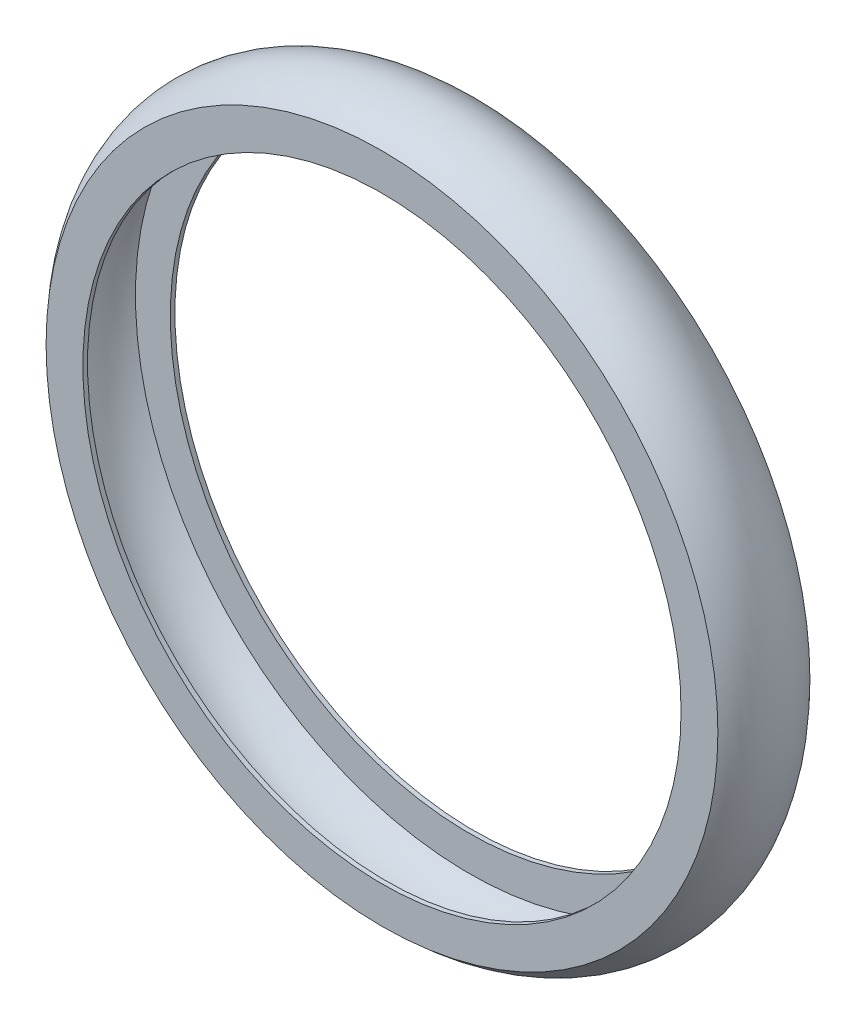
ISO-10303-21;
HEADER;
FILE_DESCRIPTION(('STEP AP214'),'2;1');
FILE_NAME('part.step','',(''),(''),'','','');
FILE_SCHEMA(('AUTOMOTIVE_DESIGN { 1 0 10303 214 1 1 1 1 }'));
ENDSEC;
DATA;
#1=APPLICATION_CONTEXT('core data for automotive mechanical design processes');
#2=APPLICATION_PROTOCOL_DEFINITION('international standard','automotive_design',2000,#1);
#3=PRODUCT_CONTEXT('',#1,'mechanical');
#4=PRODUCT('Part','Part','',(#3));
#5=PRODUCT_RELATED_PRODUCT_CATEGORY('part','',(#4));
#6=PRODUCT_DEFINITION_FORMATION('','',#4);
#7=PRODUCT_DEFINITION_CONTEXT('part definition',#1,'design');
#8=PRODUCT_DEFINITION('design','',#6,#7);
#9=PRODUCT_DEFINITION_SHAPE('','',#8);
#10=(LENGTH_UNIT() NAMED_UNIT(*) SI_UNIT(.MILLI.,.METRE.));
#11=(NAMED_UNIT(*) PLANE_ANGLE_UNIT() SI_UNIT($,.RADIAN.));
#12=(NAMED_UNIT(*) SI_UNIT($,.STERADIAN.) SOLID_ANGLE_UNIT());
#13=UNCERTAINTY_MEASURE_WITH_UNIT(LENGTH_MEASURE(1.E-05),#10,'distance_accuracy_value','');
#14=(GEOMETRIC_REPRESENTATION_CONTEXT(3) GLOBAL_UNCERTAINTY_ASSIGNED_CONTEXT((#13)) GLOBAL_UNIT_ASSIGNED_CONTEXT((#10,
#11,#12)) REPRESENTATION_CONTEXT('',''));
#15=CARTESIAN_POINT('',(0.,0.,0.));
#16=DIRECTION('',(0.,0.,1.));
#17=DIRECTION('',(1.,0.,0.));
#18=AXIS2_PLACEMENT_3D('',#15,#16,#17);
#19=CARTESIAN_POINT('',(0.,0.,75.4214559386973));
#20=DIRECTION('',(0.,0.,0.999999999999998));
#21=DIRECTION('',(1.,0.,0.));
#22=AXIS2_PLACEMENT_3D('',#19,#20,#21);
#23=CYLINDRICAL_SURFACE('',#22,165.1);
#24=CARTESIAN_POINT('',(0.,0.,48.26));
#25=DIRECTION('',(0.,0.,0.999999999999998));
#26=DIRECTION('',(1.,0.,0.));
#27=AXIS2_PLACEMENT_3D('',#24,#25,#26);
#28=CIRCLE('',#27,165.1);
#29=CARTESIAN_POINT('',(165.1,0.,48.26));
#30=VERTEX_POINT('',#29);
#31=EDGE_CURVE('E71',#30,#30,#28,.T.);
#32=ORIENTED_EDGE('',*,*,#31,.F.);
#33=EDGE_LOOP('',(#32));
#34=FACE_BOUND('',#33,.T.);
#35=CARTESIAN_POINT('',(0.,0.,50.8));
#36=DIRECTION('',(0.,0.,0.999999999999998));
#37=DIRECTION('',(1.,0.,0.));
#38=AXIS2_PLACEMENT_3D('',#35,#36,#37);
#39=CIRCLE('',#38,165.1);
#40=CARTESIAN_POINT('',(165.1,0.,50.8));
#41=VERTEX_POINT('',#40);
#42=EDGE_CURVE('E10',#41,#41,#39,.T.);
#43=ORIENTED_EDGE('',*,*,#42,.T.);
#44=EDGE_LOOP('',(#43));
#45=FACE_BOUND('',#44,.T.);
#46=ADVANCED_FACE('F34',(#34,#45),#23,.F.);
#47=CARTESIAN_POINT('',(0.,165.1,50.8));
#48=DIRECTION('',(0.,0.,-0.999999999999998));
#49=DIRECTION('',(-1.,0.,0.));
#50=AXIS2_PLACEMENT_3D('',#47,#48,#49);
#51=PLANE('',#50);
#52=ORIENTED_EDGE('',*,*,#42,.F.);
#53=EDGE_LOOP('',(#52));
#54=FACE_BOUND('',#53,.T.);
#55=CARTESIAN_POINT('',(0.,0.,50.8));
#56=DIRECTION('',(0.,0.,0.999999999999998));
#57=DIRECTION('',(1.,0.,0.));
#58=AXIS2_PLACEMENT_3D('',#55,#56,#57);
#59=CIRCLE('',#58,185.42);
#60=CARTESIAN_POINT('',(185.42,0.,50.8));
#61=VERTEX_POINT('',#60);
#62=EDGE_CURVE('E41',#61,#61,#59,.T.);
#63=ORIENTED_EDGE('',*,*,#62,.T.);
#64=EDGE_LOOP('',(#63));
#65=FACE_BOUND('',#64,.T.);
#66=ADVANCED_FACE('F80',(#54,#65),#51,.F.);
#67=CARTESIAN_POINT('',(0.,0.,25.4));
#68=DIRECTION('',(0.,0.,0.999999999999998));
#69=DIRECTION('',(1.,0.,0.));
#70=AXIS2_PLACEMENT_3D('',#67,#68,#69);
#71=TOROIDAL_SURFACE('',#70,160.019999999999,35.9210244842772);
#72=ORIENTED_EDGE('',*,*,#62,.F.);
#73=EDGE_LOOP('',(#72));
#74=FACE_BOUND('',#73,.T.);
#75=CARTESIAN_POINT('',(0.,0.,0.));
#76=DIRECTION('',(0.,0.,0.999999999999998));
#77=DIRECTION('',(1.,0.,0.));
#78=AXIS2_PLACEMENT_3D('',#75,#76,#77);
#79=CIRCLE('',#78,185.42);
#80=CARTESIAN_POINT('',(185.42,0.,0.));
#81=VERTEX_POINT('',#80);
#82=EDGE_CURVE('E47',#81,#81,#79,.T.);
#83=ORIENTED_EDGE('',*,*,#82,.T.);
#84=EDGE_LOOP('',(#83));
#85=FACE_BOUND('',#84,.T.);
#86=ADVANCED_FACE('F84',(#74,#85),#71,.T.);
#87=CARTESIAN_POINT('',(0.,165.1,0.));
#88=DIRECTION('',(0.,0.,0.999999999999998));
#89=DIRECTION('',(1.,0.,0.));
#90=AXIS2_PLACEMENT_3D('',#87,#88,#89);
#91=PLANE('',#90);
#92=ORIENTED_EDGE('',*,*,#82,.F.);
#93=EDGE_LOOP('',(#92));
#94=FACE_BOUND('',#93,.T.);
#95=CARTESIAN_POINT('',(0.,0.,0.));
#96=DIRECTION('',(0.,0.,0.999999999999998));
#97=DIRECTION('',(1.,0.,0.));
#98=AXIS2_PLACEMENT_3D('',#95,#96,#97);
#99=CIRCLE('',#98,165.1);
#100=CARTESIAN_POINT('',(165.1,0.,0.));
#101=VERTEX_POINT('',#100);
#102=EDGE_CURVE('E53',#101,#101,#99,.T.);
#103=ORIENTED_EDGE('',*,*,#102,.T.);
#104=EDGE_LOOP('',(#103));
#105=FACE_BOUND('',#104,.T.);
#106=ADVANCED_FACE('F89',(#94,#105),#91,.F.);
#107=CARTESIAN_POINT('',(0.,0.,75.4214559386973));
#108=DIRECTION('',(0.,0.,0.999999999999998));
#109=DIRECTION('',(1.,0.,0.));
#110=AXIS2_PLACEMENT_3D('',#107,#108,#109);
#111=CYLINDRICAL_SURFACE('',#110,165.1);
#112=ORIENTED_EDGE('',*,*,#102,.F.);
#113=EDGE_LOOP('',(#112));
#114=FACE_BOUND('',#113,.T.);
#115=CARTESIAN_POINT('',(0.,0.,2.53999999999999));
#116=DIRECTION('',(0.,0.,0.999999999999998));
#117=DIRECTION('',(1.,0.,0.));
#118=AXIS2_PLACEMENT_3D('',#115,#116,#117);
#119=CIRCLE('',#118,165.1);
#120=CARTESIAN_POINT('',(165.1,0.,2.53999999999999));
#121=VERTEX_POINT('',#120);
#122=EDGE_CURVE('E59',#121,#121,#119,.T.);
#123=ORIENTED_EDGE('',*,*,#122,.T.);
#124=EDGE_LOOP('',(#123));
#125=FACE_BOUND('',#124,.T.);
#126=ADVANCED_FACE('F95',(#114,#125),#111,.F.);
#127=CARTESIAN_POINT('',(0.,165.1,2.53999999999999));
#128=DIRECTION('',(0.,0.,-0.999999999999998));
#129=DIRECTION('',(-1.,0.,0.));
#130=AXIS2_PLACEMENT_3D('',#127,#128,#129);
#131=PLANE('',#130);
#132=ORIENTED_EDGE('',*,*,#122,.F.);
#133=EDGE_LOOP('',(#132));
#134=FACE_BOUND('',#133,.T.);
#135=CARTESIAN_POINT('',(0.,0.,2.53999999999999));
#136=DIRECTION('',(0.,0.,0.999999999999998));
#137=DIRECTION('',(1.,0.,0.));
#138=AXIS2_PLACEMENT_3D('',#135,#136,#137);
#139=CIRCLE('',#138,184.345155613477);
#140=CARTESIAN_POINT('',(184.345155613477,0.,2.53999999999999));
#141=VERTEX_POINT('',#140);
#142=EDGE_CURVE('E63',#141,#141,#139,.T.);
#143=ORIENTED_EDGE('',*,*,#142,.T.);
#144=EDGE_LOOP('',(#143));
#145=FACE_BOUND('',#144,.T.);
#146=ADVANCED_FACE('F99',(#134,#145),#131,.F.);
#147=CARTESIAN_POINT('',(0.,0.,25.4));
#148=DIRECTION('',(0.,0.,0.999999999999998));
#149=DIRECTION('',(1.,0.,0.));
#150=AXIS2_PLACEMENT_3D('',#147,#148,#149);
#151=TOROIDAL_SURFACE('',#150,160.019999999999,33.3810244842772);
#152=ORIENTED_EDGE('',*,*,#142,.F.);
#153=EDGE_LOOP('',(#152));
#154=FACE_BOUND('',#153,.T.);
#155=CARTESIAN_POINT('',(0.,0.,48.26));
#156=DIRECTION('',(0.,0.,0.999999999999998));
#157=DIRECTION('',(1.,0.,0.));
#158=AXIS2_PLACEMENT_3D('',#155,#156,#157);
#159=CIRCLE('',#158,184.345155613477);
#160=CARTESIAN_POINT('',(184.345155613477,0.,48.26));
#161=VERTEX_POINT('',#160);
#162=EDGE_CURVE('E67',#161,#161,#159,.T.);
#163=ORIENTED_EDGE('',*,*,#162,.T.);
#164=EDGE_LOOP('',(#163));
#165=FACE_BOUND('',#164,.T.);
#166=ADVANCED_FACE('F103',(#154,#165),#151,.F.);
#167=CARTESIAN_POINT('',(0.,165.1,48.26));
#168=DIRECTION('',(0.,0.,0.999999999999998));
#169=DIRECTION('',(1.,0.,0.));
#170=AXIS2_PLACEMENT_3D('',#167,#168,#169);
#171=PLANE('',#170);
#172=ORIENTED_EDGE('',*,*,#162,.F.);
#173=EDGE_LOOP('',(#172));
#174=FACE_BOUND('',#173,.T.);
#175=ORIENTED_EDGE('',*,*,#31,.T.);
#176=EDGE_LOOP('',(#175));
#177=FACE_BOUND('',#176,.T.);
#178=ADVANCED_FACE('F77',(#174,#177),#171,.F.);
#179=CLOSED_SHELL('',(#46,#66,#86,#106,#126,#146,#166,#178));
#180=MANIFOLD_SOLID_BREP('B2',#179);
#181=ADVANCED_BREP_SHAPE_REPRESENTATION('',(#18,#180),#14);
#182=SHAPE_DEFINITION_REPRESENTATION(#9,#181);
ENDSEC;
END-ISO-10303-21;
